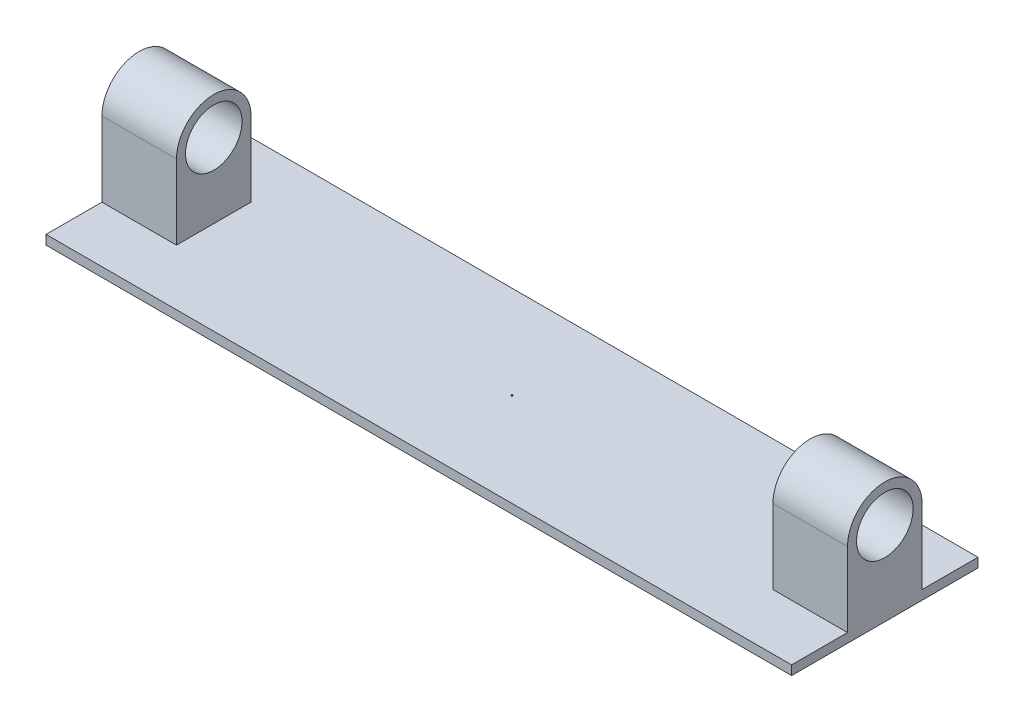
ISO-10303-21;
HEADER;
FILE_DESCRIPTION(('STEP AP214'),'2;1');
FILE_NAME('part.step','',(''),(''),'','','');
FILE_SCHEMA(('AUTOMOTIVE_DESIGN { 1 0 10303 214 1 1 1 1 }'));
ENDSEC;
DATA;
#1=APPLICATION_CONTEXT('core data for automotive mechanical design processes');
#2=APPLICATION_PROTOCOL_DEFINITION('international standard','automotive_design',2000,#1);
#3=PRODUCT_CONTEXT('',#1,'mechanical');
#4=PRODUCT('Part','Part','',(#3));
#5=PRODUCT_RELATED_PRODUCT_CATEGORY('part','',(#4));
#6=PRODUCT_DEFINITION_FORMATION('','',#4);
#7=PRODUCT_DEFINITION_CONTEXT('part definition',#1,'design');
#8=PRODUCT_DEFINITION('design','',#6,#7);
#9=PRODUCT_DEFINITION_SHAPE('','',#8);
#10=(LENGTH_UNIT() NAMED_UNIT(*) SI_UNIT(.MILLI.,.METRE.));
#11=(NAMED_UNIT(*) PLANE_ANGLE_UNIT() SI_UNIT($,.RADIAN.));
#12=(NAMED_UNIT(*) SI_UNIT($,.STERADIAN.) SOLID_ANGLE_UNIT());
#13=UNCERTAINTY_MEASURE_WITH_UNIT(LENGTH_MEASURE(1.E-05),#10,'distance_accuracy_value','');
#14=(GEOMETRIC_REPRESENTATION_CONTEXT(3) GLOBAL_UNCERTAINTY_ASSIGNED_CONTEXT((#13)) GLOBAL_UNIT_ASSIGNED_CONTEXT((#10,
#11,#12)) REPRESENTATION_CONTEXT('',''));
#15=CARTESIAN_POINT('',(0.,0.,0.));
#16=DIRECTION('',(0.,0.,1.));
#17=DIRECTION('',(1.,0.,0.));
#18=AXIS2_PLACEMENT_3D('',#15,#16,#17);
#19=CARTESIAN_POINT('',(0.,5.,0.));
#20=DIRECTION('',(0.,1.,0.));
#21=DIRECTION('',(0.,0.,1.));
#22=AXIS2_PLACEMENT_3D('',#19,#20,#21);
#23=PLANE('',#22);
#24=CARTESIAN_POINT('',(0.,5.,0.));
#25=DIRECTION('',(0.,1.,0.));
#26=DIRECTION('',(0.,0.,1.));
#27=AXIS2_PLACEMENT_3D('',#24,#25,#26);
#28=CIRCLE('',#27,0.320199732939938);
#29=CARTESIAN_POINT('',(0.,5.,0.320199732939938));
#30=VERTEX_POINT('',#29);
#31=EDGE_CURVE('E426',#30,#30,#28,.T.);
#32=ORIENTED_EDGE('',*,*,#31,.F.);
#33=EDGE_LOOP('',(#32));
#34=FACE_BOUND('',#33,.T.);
#35=DIRECTION('',(0.,0.,1.));
#36=VECTOR('',#35,1.);
#37=CARTESIAN_POINT('',(-200.,5.,-50.));
#38=LINE('',#37,#36);
#39=CARTESIAN_POINT('',(-200.,5.,-50.));
#40=VERTEX_POINT('',#39);
#41=CARTESIAN_POINT('',(-200.,5.,-20.));
#42=VERTEX_POINT('',#41);
#43=EDGE_CURVE('E148',#40,#42,#38,.T.);
#44=ORIENTED_EDGE('',*,*,#43,.T.);
#45=DIRECTION('',(-1.,0.,0.));
#46=VECTOR('',#45,1.);
#47=CARTESIAN_POINT('',(-160.,5.,-20.));
#48=LINE('',#47,#46);
#49=CARTESIAN_POINT('',(-160.,5.,-20.));
#50=VERTEX_POINT('',#49);
#51=EDGE_CURVE('E140',#50,#42,#48,.T.);
#52=ORIENTED_EDGE('',*,*,#51,.F.);
#53=DIRECTION('',(0.,0.,-1.));
#54=VECTOR('',#53,1.);
#55=CARTESIAN_POINT('',(-160.,5.,20.));
#56=LINE('',#55,#54);
#57=CARTESIAN_POINT('',(-160.,5.,20.));
#58=VERTEX_POINT('',#57);
#59=EDGE_CURVE('E126',#58,#50,#56,.T.);
#60=ORIENTED_EDGE('',*,*,#59,.F.);
#61=DIRECTION('',(-1.,0.,0.));
#62=VECTOR('',#61,1.);
#63=CARTESIAN_POINT('',(-160.,5.,20.));
#64=LINE('',#63,#62);
#65=CARTESIAN_POINT('',(-200.,5.,20.));
#66=VERTEX_POINT('',#65);
#67=EDGE_CURVE('E149',#58,#66,#64,.T.);
#68=ORIENTED_EDGE('',*,*,#67,.T.);
#69=CARTESIAN_POINT('',(-200.,5.,50.));
#70=VERTEX_POINT('',#69);
#71=EDGE_CURVE('E211',#66,#70,#38,.T.);
#72=ORIENTED_EDGE('',*,*,#71,.T.);
#73=DIRECTION('',(1.,0.,0.));
#74=VECTOR('',#73,1.);
#75=CARTESIAN_POINT('',(-200.,5.,50.));
#76=LINE('',#75,#74);
#77=CARTESIAN_POINT('',(200.,5.,50.));
#78=VERTEX_POINT('',#77);
#79=EDGE_CURVE('E206',#70,#78,#76,.T.);
#80=ORIENTED_EDGE('',*,*,#79,.T.);
#81=DIRECTION('',(0.,0.,-1.));
#82=VECTOR('',#81,1.);
#83=CARTESIAN_POINT('',(200.,5.,-50.));
#84=LINE('',#83,#82);
#85=CARTESIAN_POINT('',(200.,5.,20.));
#86=VERTEX_POINT('',#85);
#87=EDGE_CURVE('E201',#78,#86,#84,.T.);
#88=ORIENTED_EDGE('',*,*,#87,.T.);
#89=DIRECTION('',(1.,0.,0.));
#90=VECTOR('',#89,1.);
#91=CARTESIAN_POINT('',(160.,5.,20.));
#92=LINE('',#91,#90);
#93=CARTESIAN_POINT('',(160.,5.,20.));
#94=VERTEX_POINT('',#93);
#95=EDGE_CURVE('E188',#94,#86,#92,.T.);
#96=ORIENTED_EDGE('',*,*,#95,.F.);
#97=DIRECTION('',(0.,0.,-1.));
#98=VECTOR('',#97,1.);
#99=CARTESIAN_POINT('',(160.,5.,20.));
#100=LINE('',#99,#98);
#101=CARTESIAN_POINT('',(160.,5.,-20.));
#102=VERTEX_POINT('',#101);
#103=EDGE_CURVE('E172',#94,#102,#100,.T.);
#104=ORIENTED_EDGE('',*,*,#103,.T.);
#105=DIRECTION('',(1.,0.,0.));
#106=VECTOR('',#105,1.);
#107=CARTESIAN_POINT('',(160.,5.,-20.));
#108=LINE('',#107,#106);
#109=CARTESIAN_POINT('',(200.,5.,-20.));
#110=VERTEX_POINT('',#109);
#111=EDGE_CURVE('E184',#102,#110,#108,.T.);
#112=ORIENTED_EDGE('',*,*,#111,.T.);
#113=CARTESIAN_POINT('',(200.,5.,-50.));
#114=VERTEX_POINT('',#113);
#115=EDGE_CURVE('E209',#110,#114,#84,.T.);
#116=ORIENTED_EDGE('',*,*,#115,.T.);
#117=DIRECTION('',(-1.,0.,0.));
#118=VECTOR('',#117,1.);
#119=CARTESIAN_POINT('',(-200.,5.,-50.));
#120=LINE('',#119,#118);
#121=EDGE_CURVE('E208',#114,#40,#120,.T.);
#122=ORIENTED_EDGE('',*,*,#121,.T.);
#123=EDGE_LOOP('',(#44,#52,#60,#68,#72,#80,#88,#96,#104,#112,#116,#122));
#124=FACE_BOUND('',#123,.T.);
#125=ADVANCED_FACE('F33',(#34,#124),#23,.T.);
#126=CARTESIAN_POINT('',(200.,5.,-50.));
#127=DIRECTION('',(-1.,0.,0.));
#128=DIRECTION('',(0.,0.,1.));
#129=AXIS2_PLACEMENT_3D('',#126,#127,#128);
#130=PLANE('',#129);
#131=DIRECTION('',(0.,0.,-1.));
#132=VECTOR('',#131,1.);
#133=CARTESIAN_POINT('',(200.,0.,-50.));
#134=LINE('',#133,#132);
#135=CARTESIAN_POINT('',(200.,0.,50.));
#136=VERTEX_POINT('',#135);
#137=CARTESIAN_POINT('',(200.,0.,-50.));
#138=VERTEX_POINT('',#137);
#139=EDGE_CURVE('E187',#136,#138,#134,.T.);
#140=ORIENTED_EDGE('',*,*,#139,.T.);
#141=DIRECTION('',(0.,-1.,0.));
#142=VECTOR('',#141,1.);
#143=CARTESIAN_POINT('',(200.,5.,-50.));
#144=LINE('',#143,#142);
#145=EDGE_CURVE('E11',#114,#138,#144,.T.);
#146=ORIENTED_EDGE('',*,*,#145,.F.);
#147=ORIENTED_EDGE('',*,*,#115,.F.);
#148=DIRECTION('',(0.,1.,0.));
#149=VECTOR('',#148,1.);
#150=CARTESIAN_POINT('',(200.,45.,-20.));
#151=LINE('',#150,#149);
#152=CARTESIAN_POINT('',(200.,45.,-20.));
#153=VERTEX_POINT('',#152);
#154=EDGE_CURVE('E58',#110,#153,#151,.T.);
#155=ORIENTED_EDGE('',*,*,#154,.T.);
#156=CARTESIAN_POINT('',(200.,45.,0.));
#157=DIRECTION('',(1.,0.,0.));
#158=DIRECTION('',(0.,0.,-1.));
#159=AXIS2_PLACEMENT_3D('',#156,#157,#158);
#160=CIRCLE('',#159,20.);
#161=CARTESIAN_POINT('',(200.,45.,20.));
#162=VERTEX_POINT('',#161);
#163=EDGE_CURVE('E176',#153,#162,#160,.T.);
#164=ORIENTED_EDGE('',*,*,#163,.T.);
#165=DIRECTION('',(0.,-1.,0.));
#166=VECTOR('',#165,1.);
#167=CARTESIAN_POINT('',(200.,45.,20.));
#168=LINE('',#167,#166);
#169=EDGE_CURVE('E167',#162,#86,#168,.T.);
#170=ORIENTED_EDGE('',*,*,#169,.T.);
#171=ORIENTED_EDGE('',*,*,#87,.F.);
#172=DIRECTION('',(0.,-1.,0.));
#173=VECTOR('',#172,1.);
#174=CARTESIAN_POINT('',(200.,5.,50.));
#175=LINE('',#174,#173);
#176=EDGE_CURVE('E222',#78,#136,#175,.T.);
#177=ORIENTED_EDGE('',*,*,#176,.T.);
#178=EDGE_LOOP('',(#140,#146,#147,#155,#164,#170,#171,#177));
#179=FACE_BOUND('',#178,.T.);
#180=CARTESIAN_POINT('',(200.,45.,0.));
#181=DIRECTION('',(1.,0.,0.));
#182=DIRECTION('',(0.,0.,-1.));
#183=AXIS2_PLACEMENT_3D('',#180,#181,#182);
#184=CIRCLE('',#183,15.1805179273214);
#185=CARTESIAN_POINT('',(200.,45.,-15.1805179273214));
#186=VERTEX_POINT('',#185);
#187=EDGE_CURVE('E160',#186,#186,#184,.T.);
#188=ORIENTED_EDGE('',*,*,#187,.F.);
#189=EDGE_LOOP('',(#188));
#190=FACE_BOUND('',#189,.T.);
#191=ADVANCED_FACE('F35',(#179,#190),#130,.F.);
#192=CARTESIAN_POINT('',(-200.,5.,-50.));
#193=DIRECTION('',(0.,0.,1.));
#194=DIRECTION('',(1.,0.,0.));
#195=AXIS2_PLACEMENT_3D('',#192,#193,#194);
#196=PLANE('',#195);
#197=DIRECTION('',(-1.,0.,0.));
#198=VECTOR('',#197,1.);
#199=CARTESIAN_POINT('',(-200.,0.,-50.));
#200=LINE('',#199,#198);
#201=CARTESIAN_POINT('',(-200.,0.,-50.));
#202=VERTEX_POINT('',#201);
#203=EDGE_CURVE('E224',#138,#202,#200,.T.);
#204=ORIENTED_EDGE('',*,*,#203,.T.);
#205=DIRECTION('',(0.,-1.,0.));
#206=VECTOR('',#205,1.);
#207=CARTESIAN_POINT('',(-200.,5.,-50.));
#208=LINE('',#207,#206);
#209=EDGE_CURVE('E42',#40,#202,#208,.T.);
#210=ORIENTED_EDGE('',*,*,#209,.F.);
#211=ORIENTED_EDGE('',*,*,#121,.F.);
#212=ORIENTED_EDGE('',*,*,#145,.T.);
#213=EDGE_LOOP('',(#204,#210,#211,#212));
#214=FACE_BOUND('',#213,.T.);
#215=ADVANCED_FACE('F249',(#214),#196,.F.);
#216=CARTESIAN_POINT('',(-200.,5.,-50.));
#217=DIRECTION('',(1.,0.,0.));
#218=DIRECTION('',(0.,0.,-1.));
#219=AXIS2_PLACEMENT_3D('',#216,#217,#218);
#220=PLANE('',#219);
#221=DIRECTION('',(0.,0.,1.));
#222=VECTOR('',#221,1.);
#223=CARTESIAN_POINT('',(-200.,0.,-50.));
#224=LINE('',#223,#222);
#225=CARTESIAN_POINT('',(-200.,0.,50.));
#226=VERTEX_POINT('',#225);
#227=EDGE_CURVE('E226',#202,#226,#224,.T.);
#228=ORIENTED_EDGE('',*,*,#227,.T.);
#229=DIRECTION('',(0.,-1.,0.));
#230=VECTOR('',#229,1.);
#231=CARTESIAN_POINT('',(-200.,5.,50.));
#232=LINE('',#231,#230);
#233=EDGE_CURVE('E230',#70,#226,#232,.T.);
#234=ORIENTED_EDGE('',*,*,#233,.F.);
#235=ORIENTED_EDGE('',*,*,#71,.F.);
#236=DIRECTION('',(0.,-1.,0.));
#237=VECTOR('',#236,1.);
#238=CARTESIAN_POINT('',(-200.,45.,20.));
#239=LINE('',#238,#237);
#240=CARTESIAN_POINT('',(-200.,45.,20.));
#241=VERTEX_POINT('',#240);
#242=EDGE_CURVE('E50',#241,#66,#239,.T.);
#243=ORIENTED_EDGE('',*,*,#242,.F.);
#244=CARTESIAN_POINT('',(-200.,45.,0.));
#245=DIRECTION('',(1.,0.,0.));
#246=DIRECTION('',(0.,0.,-1.));
#247=AXIS2_PLACEMENT_3D('',#244,#245,#246);
#248=CIRCLE('',#247,20.);
#249=CARTESIAN_POINT('',(-200.,45.,-20.));
#250=VERTEX_POINT('',#249);
#251=EDGE_CURVE('E144',#250,#241,#248,.T.);
#252=ORIENTED_EDGE('',*,*,#251,.F.);
#253=DIRECTION('',(0.,1.,0.));
#254=VECTOR('',#253,1.);
#255=CARTESIAN_POINT('',(-200.,45.,-20.));
#256=LINE('',#255,#254);
#257=EDGE_CURVE('E435',#42,#250,#256,.T.);
#258=ORIENTED_EDGE('',*,*,#257,.F.);
#259=ORIENTED_EDGE('',*,*,#43,.F.);
#260=ORIENTED_EDGE('',*,*,#209,.T.);
#261=EDGE_LOOP('',(#228,#234,#235,#243,#252,#258,#259,#260));
#262=FACE_BOUND('',#261,.T.);
#263=CARTESIAN_POINT('',(-200.,45.,0.));
#264=DIRECTION('',(1.,0.,0.));
#265=DIRECTION('',(0.,0.,-1.));
#266=AXIS2_PLACEMENT_3D('',#263,#264,#265);
#267=CIRCLE('',#266,15.1805179273214);
#268=CARTESIAN_POINT('',(-200.,45.,-15.1805179273214));
#269=VERTEX_POINT('',#268);
#270=EDGE_CURVE('E425',#269,#269,#267,.T.);
#271=ORIENTED_EDGE('',*,*,#270,.T.);
#272=EDGE_LOOP('',(#271));
#273=FACE_BOUND('',#272,.T.);
#274=ADVANCED_FACE('F236',(#262,#273),#220,.F.);
#275=CARTESIAN_POINT('',(-200.,5.,50.));
#276=DIRECTION('',(0.,0.,-1.));
#277=DIRECTION('',(-1.,0.,0.));
#278=AXIS2_PLACEMENT_3D('',#275,#276,#277);
#279=PLANE('',#278);
#280=DIRECTION('',(1.,0.,0.));
#281=VECTOR('',#280,1.);
#282=CARTESIAN_POINT('',(-200.,0.,50.));
#283=LINE('',#282,#281);
#284=EDGE_CURVE('E213',#226,#136,#283,.T.);
#285=ORIENTED_EDGE('',*,*,#284,.T.);
#286=ORIENTED_EDGE('',*,*,#176,.F.);
#287=ORIENTED_EDGE('',*,*,#79,.F.);
#288=ORIENTED_EDGE('',*,*,#233,.T.);
#289=EDGE_LOOP('',(#285,#286,#287,#288));
#290=FACE_BOUND('',#289,.T.);
#291=ADVANCED_FACE('F246',(#290),#279,.F.);
#292=CARTESIAN_POINT('',(0.,0.,0.));
#293=DIRECTION('',(0.,1.,0.));
#294=DIRECTION('',(0.,0.,1.));
#295=AXIS2_PLACEMENT_3D('',#292,#293,#294);
#296=PLANE('',#295);
#297=ORIENTED_EDGE('',*,*,#139,.F.);
#298=ORIENTED_EDGE('',*,*,#284,.F.);
#299=ORIENTED_EDGE('',*,*,#227,.F.);
#300=ORIENTED_EDGE('',*,*,#203,.F.);
#301=EDGE_LOOP('',(#297,#298,#299,#300));
#302=FACE_BOUND('',#301,.T.);
#303=ADVANCED_FACE('F244',(#302),#296,.F.);
#304=CARTESIAN_POINT('',(160.,45.,-20.));
#305=DIRECTION('',(0.,0.,-1.));
#306=DIRECTION('',(0.,1.,0.));
#307=AXIS2_PLACEMENT_3D('',#304,#305,#306);
#308=PLANE('',#307);
#309=ORIENTED_EDGE('',*,*,#154,.F.);
#310=ORIENTED_EDGE('',*,*,#111,.F.);
#311=DIRECTION('',(0.,1.,0.));
#312=VECTOR('',#311,1.);
#313=CARTESIAN_POINT('',(160.,45.,-20.));
#314=LINE('',#313,#312);
#315=CARTESIAN_POINT('',(160.,45.,-20.));
#316=VERTEX_POINT('',#315);
#317=EDGE_CURVE('E163',#102,#316,#314,.T.);
#318=ORIENTED_EDGE('',*,*,#317,.T.);
#319=DIRECTION('',(1.,0.,0.));
#320=VECTOR('',#319,1.);
#321=CARTESIAN_POINT('',(160.,45.,-20.));
#322=LINE('',#321,#320);
#323=EDGE_CURVE('E175',#316,#153,#322,.T.);
#324=ORIENTED_EDGE('',*,*,#323,.T.);
#325=EDGE_LOOP('',(#309,#310,#318,#324));
#326=FACE_BOUND('',#325,.T.);
#327=ADVANCED_FACE('F252',(#326),#308,.T.);
#328=CARTESIAN_POINT('',(160.,45.,20.));
#329=DIRECTION('',(0.,0.,1.));
#330=DIRECTION('',(0.,-1.,0.));
#331=AXIS2_PLACEMENT_3D('',#328,#329,#330);
#332=PLANE('',#331);
#333=ORIENTED_EDGE('',*,*,#169,.F.);
#334=DIRECTION('',(1.,0.,0.));
#335=VECTOR('',#334,1.);
#336=CARTESIAN_POINT('',(160.,45.,20.));
#337=LINE('',#336,#335);
#338=CARTESIAN_POINT('',(160.,45.,20.));
#339=VERTEX_POINT('',#338);
#340=EDGE_CURVE('E181',#339,#162,#337,.T.);
#341=ORIENTED_EDGE('',*,*,#340,.F.);
#342=DIRECTION('',(0.,-1.,0.));
#343=VECTOR('',#342,1.);
#344=CARTESIAN_POINT('',(160.,45.,20.));
#345=LINE('',#344,#343);
#346=EDGE_CURVE('E170',#339,#94,#345,.T.);
#347=ORIENTED_EDGE('',*,*,#346,.T.);
#348=ORIENTED_EDGE('',*,*,#95,.T.);
#349=EDGE_LOOP('',(#333,#341,#347,#348));
#350=FACE_BOUND('',#349,.T.);
#351=ADVANCED_FACE('F259',(#350),#332,.T.);
#352=CARTESIAN_POINT('',(160.,45.,0.));
#353=DIRECTION('',(1.,0.,0.));
#354=DIRECTION('',(0.,0.,-1.));
#355=AXIS2_PLACEMENT_3D('',#352,#353,#354);
#356=CYLINDRICAL_SURFACE('',#355,20.);
#357=ORIENTED_EDGE('',*,*,#163,.F.);
#358=ORIENTED_EDGE('',*,*,#323,.F.);
#359=CARTESIAN_POINT('',(160.,45.,0.));
#360=DIRECTION('',(1.,0.,0.));
#361=DIRECTION('',(0.,0.,-1.));
#362=AXIS2_PLACEMENT_3D('',#359,#360,#361);
#363=CIRCLE('',#362,20.);
#364=EDGE_CURVE('E166',#316,#339,#363,.T.);
#365=ORIENTED_EDGE('',*,*,#364,.T.);
#366=ORIENTED_EDGE('',*,*,#340,.T.);
#367=EDGE_LOOP('',(#357,#358,#365,#366));
#368=FACE_BOUND('',#367,.T.);
#369=ADVANCED_FACE('F258',(#368),#356,.T.);
#370=CARTESIAN_POINT('',(160.,45.,0.));
#371=DIRECTION('',(1.,0.,0.));
#372=DIRECTION('',(0.,0.,-1.));
#373=AXIS2_PLACEMENT_3D('',#370,#371,#372);
#374=PLANE('',#373);
#375=CARTESIAN_POINT('',(160.,45.,0.));
#376=DIRECTION('',(1.,0.,0.));
#377=DIRECTION('',(0.,0.,-1.));
#378=AXIS2_PLACEMENT_3D('',#375,#376,#377);
#379=CIRCLE('',#378,15.1805179273214);
#380=CARTESIAN_POINT('',(160.,45.,-15.1805179273214));
#381=VERTEX_POINT('',#380);
#382=EDGE_CURVE('E157',#381,#381,#379,.T.);
#383=ORIENTED_EDGE('',*,*,#382,.T.);
#384=EDGE_LOOP('',(#383));
#385=FACE_BOUND('',#384,.T.);
#386=ORIENTED_EDGE('',*,*,#317,.F.);
#387=ORIENTED_EDGE('',*,*,#103,.F.);
#388=ORIENTED_EDGE('',*,*,#346,.F.);
#389=ORIENTED_EDGE('',*,*,#364,.F.);
#390=EDGE_LOOP('',(#386,#387,#388,#389));
#391=FACE_BOUND('',#390,.T.);
#392=ADVANCED_FACE('F255',(#385,#391),#374,.F.);
#393=CARTESIAN_POINT('',(160.,45.,0.));
#394=DIRECTION('',(1.,0.,0.));
#395=DIRECTION('',(0.,0.,-1.));
#396=AXIS2_PLACEMENT_3D('',#393,#394,#395);
#397=CYLINDRICAL_SURFACE('',#396,15.1805179273214);
#398=ORIENTED_EDGE('',*,*,#382,.F.);
#399=EDGE_LOOP('',(#398));
#400=FACE_BOUND('',#399,.T.);
#401=ORIENTED_EDGE('',*,*,#187,.T.);
#402=EDGE_LOOP('',(#401));
#403=FACE_BOUND('',#402,.T.);
#404=ADVANCED_FACE('F327',(#400,#403),#397,.F.);
#405=CARTESIAN_POINT('',(-160.,45.,0.));
#406=DIRECTION('',(-1.,0.,0.));
#407=DIRECTION('',(0.,0.,-1.));
#408=AXIS2_PLACEMENT_3D('',#405,#406,#407);
#409=PLANE('',#408);
#410=DIRECTION('',(0.,1.,0.));
#411=VECTOR('',#410,1.);
#412=CARTESIAN_POINT('',(-160.,45.,-20.));
#413=LINE('',#412,#411);
#414=CARTESIAN_POINT('',(-160.,45.,-20.));
#415=VERTEX_POINT('',#414);
#416=EDGE_CURVE('E130',#50,#415,#413,.T.);
#417=ORIENTED_EDGE('',*,*,#416,.T.);
#418=CARTESIAN_POINT('',(-160.,45.,0.));
#419=DIRECTION('',(1.,0.,0.));
#420=DIRECTION('',(0.,0.,-1.));
#421=AXIS2_PLACEMENT_3D('',#418,#419,#420);
#422=CIRCLE('',#421,20.);
#423=CARTESIAN_POINT('',(-160.,45.,20.));
#424=VERTEX_POINT('',#423);
#425=EDGE_CURVE('E150',#415,#424,#422,.T.);
#426=ORIENTED_EDGE('',*,*,#425,.T.);
#427=DIRECTION('',(0.,-1.,0.));
#428=VECTOR('',#427,1.);
#429=CARTESIAN_POINT('',(-160.,45.,20.));
#430=LINE('',#429,#428);
#431=EDGE_CURVE('E133',#424,#58,#430,.T.);
#432=ORIENTED_EDGE('',*,*,#431,.T.);
#433=ORIENTED_EDGE('',*,*,#59,.T.);
#434=EDGE_LOOP('',(#417,#426,#432,#433));
#435=FACE_BOUND('',#434,.T.);
#436=CARTESIAN_POINT('',(-160.,45.,0.));
#437=DIRECTION('',(1.,0.,0.));
#438=DIRECTION('',(0.,0.,-1.));
#439=AXIS2_PLACEMENT_3D('',#436,#437,#438);
#440=CIRCLE('',#439,15.1805179273214);
#441=CARTESIAN_POINT('',(-160.,45.,-15.1805179273214));
#442=VERTEX_POINT('',#441);
#443=EDGE_CURVE('E429',#442,#442,#440,.T.);
#444=ORIENTED_EDGE('',*,*,#443,.F.);
#445=EDGE_LOOP('',(#444));
#446=FACE_BOUND('',#445,.T.);
#447=ADVANCED_FACE('F128',(#435,#446),#409,.F.);
#448=CARTESIAN_POINT('',(-160.,45.,-20.));
#449=DIRECTION('',(0.,0.,1.));
#450=DIRECTION('',(0.,-1.,0.));
#451=AXIS2_PLACEMENT_3D('',#448,#449,#450);
#452=PLANE('',#451);
#453=ORIENTED_EDGE('',*,*,#257,.T.);
#454=DIRECTION('',(-1.,0.,0.));
#455=VECTOR('',#454,1.);
#456=CARTESIAN_POINT('',(-160.,45.,-20.));
#457=LINE('',#456,#455);
#458=EDGE_CURVE('E143',#415,#250,#457,.T.);
#459=ORIENTED_EDGE('',*,*,#458,.F.);
#460=ORIENTED_EDGE('',*,*,#416,.F.);
#461=ORIENTED_EDGE('',*,*,#51,.T.);
#462=EDGE_LOOP('',(#453,#459,#460,#461));
#463=FACE_BOUND('',#462,.T.);
#464=ADVANCED_FACE('F139',(#463),#452,.F.);
#465=CARTESIAN_POINT('',(-160.,45.,0.));
#466=DIRECTION('',(-1.,0.,0.));
#467=DIRECTION('',(0.,0.,1.));
#468=AXIS2_PLACEMENT_3D('',#465,#466,#467);
#469=CYLINDRICAL_SURFACE('',#468,20.);
#470=ORIENTED_EDGE('',*,*,#251,.T.);
#471=DIRECTION('',(-1.,0.,0.));
#472=VECTOR('',#471,1.);
#473=CARTESIAN_POINT('',(-160.,45.,20.));
#474=LINE('',#473,#472);
#475=EDGE_CURVE('E152',#424,#241,#474,.T.);
#476=ORIENTED_EDGE('',*,*,#475,.F.);
#477=ORIENTED_EDGE('',*,*,#425,.F.);
#478=ORIENTED_EDGE('',*,*,#458,.T.);
#479=EDGE_LOOP('',(#470,#476,#477,#478));
#480=FACE_BOUND('',#479,.T.);
#481=ADVANCED_FACE('F350',(#480),#469,.T.);
#482=CARTESIAN_POINT('',(-160.,45.,20.));
#483=DIRECTION('',(0.,0.,-1.));
#484=DIRECTION('',(0.,1.,0.));
#485=AXIS2_PLACEMENT_3D('',#482,#483,#484);
#486=PLANE('',#485);
#487=ORIENTED_EDGE('',*,*,#242,.T.);
#488=ORIENTED_EDGE('',*,*,#67,.F.);
#489=ORIENTED_EDGE('',*,*,#431,.F.);
#490=ORIENTED_EDGE('',*,*,#475,.T.);
#491=EDGE_LOOP('',(#487,#488,#489,#490));
#492=FACE_BOUND('',#491,.T.);
#493=ADVANCED_FACE('F357',(#492),#486,.F.);
#494=CARTESIAN_POINT('',(-160.,45.,0.));
#495=DIRECTION('',(-1.,0.,0.));
#496=DIRECTION('',(0.,0.,1.));
#497=AXIS2_PLACEMENT_3D('',#494,#495,#496);
#498=CYLINDRICAL_SURFACE('',#497,15.1805179273214);
#499=ORIENTED_EDGE('',*,*,#443,.T.);
#500=EDGE_LOOP('',(#499));
#501=FACE_BOUND('',#500,.T.);
#502=ORIENTED_EDGE('',*,*,#270,.F.);
#503=EDGE_LOOP('',(#502));
#504=FACE_BOUND('',#503,.T.);
#505=ADVANCED_FACE('F365',(#501,#504),#498,.F.);
#506=CARTESIAN_POINT('',(0.,5.5,0.));
#507=DIRECTION('',(0.,-1.,0.));
#508=DIRECTION('',(0.,0.,-1.));
#509=AXIS2_PLACEMENT_3D('',#506,#507,#508);
#510=CYLINDRICAL_SURFACE('',#509,0.320199732939938);
#511=CARTESIAN_POINT('',(0.,5.5,0.));
#512=DIRECTION('',(0.,1.,0.));
#513=DIRECTION('',(0.,0.,1.));
#514=AXIS2_PLACEMENT_3D('',#511,#512,#513);
#515=CIRCLE('',#514,0.320199732939938);
#516=CARTESIAN_POINT('',(0.,5.5,0.320199732939938));
#517=VERTEX_POINT('',#516);
#518=EDGE_CURVE('E424',#517,#517,#515,.T.);
#519=ORIENTED_EDGE('',*,*,#518,.F.);
#520=EDGE_LOOP('',(#519));
#521=FACE_BOUND('',#520,.T.);
#522=ORIENTED_EDGE('',*,*,#31,.T.);
#523=EDGE_LOOP('',(#522));
#524=FACE_BOUND('',#523,.T.);
#525=ADVANCED_FACE('F371',(#521,#524),#510,.T.);
#526=CARTESIAN_POINT('',(0.,5.5,0.));
#527=DIRECTION('',(0.,1.,0.));
#528=DIRECTION('',(0.,0.,1.));
#529=AXIS2_PLACEMENT_3D('',#526,#527,#528);
#530=PLANE('',#529);
#531=ORIENTED_EDGE('',*,*,#518,.T.);
#532=EDGE_LOOP('',(#531));
#533=FACE_BOUND('',#532,.T.);
#534=ADVANCED_FACE('F378',(#533),#530,.T.);
#535=CLOSED_SHELL('',(#125,#191,#215,#274,#291,#303,#327,#351,#369,#392,#404,#447,#464,#481,
#493,#505,#525,#534));
#536=MANIFOLD_SOLID_BREP('B2',#535);
#537=ADVANCED_BREP_SHAPE_REPRESENTATION('',(#18,#536),#14);
#538=SHAPE_DEFINITION_REPRESENTATION(#9,#537);
ENDSEC;
END-ISO-10303-21;
